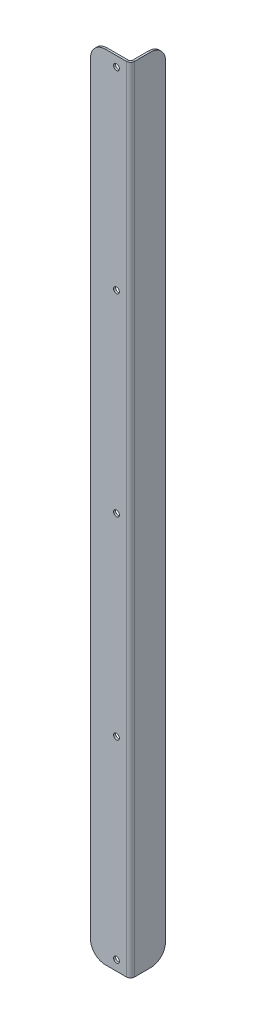
ISO-10303-21;
HEADER;
FILE_DESCRIPTION(('STEP AP214'),'2;1');
FILE_NAME('part.step','',(''),(''),'','','');
FILE_SCHEMA(('AUTOMOTIVE_DESIGN { 1 0 10303 214 1 1 1 1 }'));
ENDSEC;
DATA;
#1=APPLICATION_CONTEXT('core data for automotive mechanical design processes');
#2=APPLICATION_PROTOCOL_DEFINITION('international standard','automotive_design',2000,#1);
#3=PRODUCT_CONTEXT('',#1,'mechanical');
#4=PRODUCT('Part','Part','',(#3));
#5=PRODUCT_RELATED_PRODUCT_CATEGORY('part','',(#4));
#6=PRODUCT_DEFINITION_FORMATION('','',#4);
#7=PRODUCT_DEFINITION_CONTEXT('part definition',#1,'design');
#8=PRODUCT_DEFINITION('design','',#6,#7);
#9=PRODUCT_DEFINITION_SHAPE('','',#8);
#10=(LENGTH_UNIT() NAMED_UNIT(*) SI_UNIT(.MILLI.,.METRE.));
#11=(NAMED_UNIT(*) PLANE_ANGLE_UNIT() SI_UNIT($,.RADIAN.));
#12=(NAMED_UNIT(*) SI_UNIT($,.STERADIAN.) SOLID_ANGLE_UNIT());
#13=UNCERTAINTY_MEASURE_WITH_UNIT(LENGTH_MEASURE(1.E-05),#10,'distance_accuracy_value','');
#14=(GEOMETRIC_REPRESENTATION_CONTEXT(3) GLOBAL_UNCERTAINTY_ASSIGNED_CONTEXT((#13)) GLOBAL_UNIT_ASSIGNED_CONTEXT((#10,
#11,#12)) REPRESENTATION_CONTEXT('',''));
#15=CARTESIAN_POINT('',(0.,0.,0.));
#16=DIRECTION('',(0.,0.,1.));
#17=DIRECTION('',(1.,0.,0.));
#18=AXIS2_PLACEMENT_3D('',#15,#16,#17);
#19=CARTESIAN_POINT('',(6.00749999999836,386.,0.));
#20=DIRECTION('',(0.,0.,-1.));
#21=DIRECTION('',(1.,0.,0.));
#22=AXIS2_PLACEMENT_3D('',#19,#20,#21);
#23=CYLINDRICAL_SURFACE('',#22,2.9);
#24=CARTESIAN_POINT('',(6.00749999999836,386.,2.00000000000001));
#25=DIRECTION('',(0.,0.,1.));
#26=DIRECTION('',(1.,0.,0.));
#27=AXIS2_PLACEMENT_3D('',#24,#25,#26);
#28=CIRCLE('',#27,2.9);
#29=CARTESIAN_POINT('',(8.90749999999836,386.,2.00000000000001));
#30=VERTEX_POINT('',#29);
#31=EDGE_CURVE('E241',#30,#30,#28,.T.);
#32=ORIENTED_EDGE('',*,*,#31,.T.);
#33=EDGE_LOOP('',(#32));
#34=FACE_BOUND('',#33,.T.);
#35=CARTESIAN_POINT('',(6.00749999999836,386.,0.));
#36=DIRECTION('',(0.,0.,1.));
#37=DIRECTION('',(1.,0.,0.));
#38=AXIS2_PLACEMENT_3D('',#35,#36,#37);
#39=CIRCLE('',#38,2.9);
#40=CARTESIAN_POINT('',(8.90749999999836,386.,0.));
#41=VERTEX_POINT('',#40);
#42=EDGE_CURVE('E245',#41,#41,#39,.T.);
#43=ORIENTED_EDGE('',*,*,#42,.F.);
#44=EDGE_LOOP('',(#43));
#45=FACE_BOUND('',#44,.T.);
#46=ADVANCED_FACE('F43',(#34,#45),#23,.F.);
#47=CARTESIAN_POINT('',(6.00749999999836,193.,0.));
#48=DIRECTION('',(0.,0.,-1.));
#49=DIRECTION('',(1.,0.,0.));
#50=AXIS2_PLACEMENT_3D('',#47,#48,#49);
#51=CYLINDRICAL_SURFACE('',#50,2.9);
#52=CARTESIAN_POINT('',(6.00749999999836,193.,2.00000000000001));
#53=DIRECTION('',(0.,0.,1.));
#54=DIRECTION('',(1.,0.,0.));
#55=AXIS2_PLACEMENT_3D('',#52,#53,#54);
#56=CIRCLE('',#55,2.9);
#57=CARTESIAN_POINT('',(8.90749999999836,193.,2.00000000000001));
#58=VERTEX_POINT('',#57);
#59=EDGE_CURVE('E233',#58,#58,#56,.T.);
#60=ORIENTED_EDGE('',*,*,#59,.T.);
#61=EDGE_LOOP('',(#60));
#62=FACE_BOUND('',#61,.T.);
#63=CARTESIAN_POINT('',(6.00749999999836,193.,0.));
#64=DIRECTION('',(0.,0.,1.));
#65=DIRECTION('',(1.,0.,0.));
#66=AXIS2_PLACEMENT_3D('',#63,#64,#65);
#67=CIRCLE('',#66,2.9);
#68=CARTESIAN_POINT('',(8.90749999999836,193.,0.));
#69=VERTEX_POINT('',#68);
#70=EDGE_CURVE('E237',#69,#69,#67,.T.);
#71=ORIENTED_EDGE('',*,*,#70,.F.);
#72=EDGE_LOOP('',(#71));
#73=FACE_BOUND('',#72,.T.);
#74=ADVANCED_FACE('F387',(#62,#73),#51,.F.);
#75=CARTESIAN_POINT('',(6.00749999999836,0.,0.));
#76=DIRECTION('',(0.,0.,-1.));
#77=DIRECTION('',(1.,0.,0.));
#78=AXIS2_PLACEMENT_3D('',#75,#76,#77);
#79=CYLINDRICAL_SURFACE('',#78,2.9);
#80=CARTESIAN_POINT('',(6.00749999999836,0.,2.00000000000001));
#81=DIRECTION('',(0.,0.,1.));
#82=DIRECTION('',(1.,0.,0.));
#83=AXIS2_PLACEMENT_3D('',#80,#81,#82);
#84=CIRCLE('',#83,2.9);
#85=CARTESIAN_POINT('',(8.90749999999836,0.,2.00000000000001));
#86=VERTEX_POINT('',#85);
#87=EDGE_CURVE('E216',#86,#86,#84,.T.);
#88=ORIENTED_EDGE('',*,*,#87,.T.);
#89=EDGE_LOOP('',(#88));
#90=FACE_BOUND('',#89,.T.);
#91=CARTESIAN_POINT('',(6.00749999999836,0.,0.));
#92=DIRECTION('',(0.,0.,1.));
#93=DIRECTION('',(1.,0.,0.));
#94=AXIS2_PLACEMENT_3D('',#91,#92,#93);
#95=CIRCLE('',#94,2.9);
#96=CARTESIAN_POINT('',(8.90749999999836,0.,0.));
#97=VERTEX_POINT('',#96);
#98=EDGE_CURVE('E229',#97,#97,#95,.T.);
#99=ORIENTED_EDGE('',*,*,#98,.F.);
#100=EDGE_LOOP('',(#99));
#101=FACE_BOUND('',#100,.T.);
#102=ADVANCED_FACE('F393',(#90,#101),#79,.F.);
#103=CARTESIAN_POINT('',(-20.,396.,2.));
#104=DIRECTION('',(0.,1.,0.));
#105=DIRECTION('',(0.,0.,-1.));
#106=AXIS2_PLACEMENT_3D('',#103,#104,#105);
#107=PLANE('',#106);
#108=DIRECTION('',(-1.,0.,0.));
#109=VECTOR('',#108,1.);
#110=CARTESIAN_POINT('',(-20.,396.,2.));
#111=LINE('',#110,#109);
#112=CARTESIAN_POINT('',(16.,396.,2.00000000000001));
#113=VERTEX_POINT('',#112);
#114=CARTESIAN_POINT('',(-5.,396.,2.));
#115=VERTEX_POINT('',#114);
#116=EDGE_CURVE('E203',#113,#115,#111,.T.);
#117=ORIENTED_EDGE('',*,*,#116,.F.);
#118=DIRECTION('',(0.,0.,1.));
#119=VECTOR('',#118,1.);
#120=CARTESIAN_POINT('',(16.,396.,0.));
#121=LINE('',#120,#119);
#122=CARTESIAN_POINT('',(16.,396.,0.));
#123=VERTEX_POINT('',#122);
#124=EDGE_CURVE('E175',#123,#113,#121,.T.);
#125=ORIENTED_EDGE('',*,*,#124,.F.);
#126=DIRECTION('',(-1.,0.,0.));
#127=VECTOR('',#126,1.);
#128=CARTESIAN_POINT('',(-20.,396.,0.));
#129=LINE('',#128,#127);
#130=CARTESIAN_POINT('',(-5.,396.,0.));
#131=VERTEX_POINT('',#130);
#132=EDGE_CURVE('E200',#123,#131,#129,.T.);
#133=ORIENTED_EDGE('',*,*,#132,.T.);
#134=DIRECTION('',(0.,0.,-1.));
#135=VECTOR('',#134,1.);
#136=CARTESIAN_POINT('',(-5.,396.,2.));
#137=LINE('',#136,#135);
#138=EDGE_CURVE('E270',#115,#131,#137,.T.);
#139=ORIENTED_EDGE('',*,*,#138,.F.);
#140=EDGE_LOOP('',(#117,#125,#133,#139));
#141=FACE_BOUND('',#140,.T.);
#142=ADVANCED_FACE('F365',(#141),#107,.T.);
#143=CARTESIAN_POINT('',(0.,0.,2.));
#144=DIRECTION('',(0.,0.,1.));
#145=DIRECTION('',(-1.,0.,0.));
#146=AXIS2_PLACEMENT_3D('',#143,#144,#145);
#147=PLANE('',#146);
#148=CARTESIAN_POINT('',(6.00749999999836,-193.,2.00000000000001));
#149=DIRECTION('',(0.,0.,1.));
#150=DIRECTION('',(1.,0.,0.));
#151=AXIS2_PLACEMENT_3D('',#148,#149,#150);
#152=CIRCLE('',#151,2.9);
#153=CARTESIAN_POINT('',(8.90749999999836,-193.,2.00000000000001));
#154=VERTEX_POINT('',#153);
#155=EDGE_CURVE('E310',#154,#154,#152,.T.);
#156=ORIENTED_EDGE('',*,*,#155,.F.);
#157=EDGE_LOOP('',(#156));
#158=FACE_BOUND('',#157,.T.);
#159=CARTESIAN_POINT('',(6.00749999999836,-386.,2.00000000000001));
#160=DIRECTION('',(0.,0.,1.));
#161=DIRECTION('',(1.,0.,0.));
#162=AXIS2_PLACEMENT_3D('',#159,#160,#161);
#163=CIRCLE('',#162,2.9);
#164=CARTESIAN_POINT('',(8.90749999999836,-386.,2.00000000000001));
#165=VERTEX_POINT('',#164);
#166=EDGE_CURVE('E299',#165,#165,#163,.T.);
#167=ORIENTED_EDGE('',*,*,#166,.F.);
#168=EDGE_LOOP('',(#167));
#169=FACE_BOUND('',#168,.T.);
#170=DIRECTION('',(0.,-1.,0.));
#171=VECTOR('',#170,1.);
#172=CARTESIAN_POINT('',(-20.,-396.,2.));
#173=LINE('',#172,#171);
#174=CARTESIAN_POINT('',(-20.,381.,2.));
#175=VERTEX_POINT('',#174);
#176=CARTESIAN_POINT('',(-20.,-381.,2.));
#177=VERTEX_POINT('',#176);
#178=EDGE_CURVE('E207',#175,#177,#173,.T.);
#179=ORIENTED_EDGE('',*,*,#178,.T.);
#180=CARTESIAN_POINT('',(-5.,-381.,2.));
#181=DIRECTION('',(0.,0.,-1.));
#182=DIRECTION('',(-1.,0.,0.));
#183=AXIS2_PLACEMENT_3D('',#180,#181,#182);
#184=CIRCLE('',#183,15.);
#185=CARTESIAN_POINT('',(-5.,-396.,2.));
#186=VERTEX_POINT('',#185);
#187=EDGE_CURVE('E286',#186,#177,#184,.T.);
#188=ORIENTED_EDGE('',*,*,#187,.F.);
#189=DIRECTION('',(1.,0.,0.));
#190=VECTOR('',#189,1.);
#191=CARTESIAN_POINT('',(-20.,-396.,2.));
#192=LINE('',#191,#190);
#193=CARTESIAN_POINT('',(16.,-396.,2.));
#194=VERTEX_POINT('',#193);
#195=EDGE_CURVE('E212',#186,#194,#192,.T.);
#196=ORIENTED_EDGE('',*,*,#195,.T.);
#197=DIRECTION('',(0.,1.,0.));
#198=VECTOR('',#197,1.);
#199=CARTESIAN_POINT('',(16.,396.,2.00000000000001));
#200=LINE('',#199,#198);
#201=EDGE_CURVE('E178',#113,#194,#200,.F.);
#202=ORIENTED_EDGE('',*,*,#201,.F.);
#203=ORIENTED_EDGE('',*,*,#116,.T.);
#204=CARTESIAN_POINT('',(-5.,381.,2.));
#205=DIRECTION('',(0.,0.,-1.));
#206=DIRECTION('',(-1.,0.,0.));
#207=AXIS2_PLACEMENT_3D('',#204,#205,#206);
#208=CIRCLE('',#207,15.);
#209=EDGE_CURVE('E289',#175,#115,#208,.T.);
#210=ORIENTED_EDGE('',*,*,#209,.F.);
#211=EDGE_LOOP('',(#179,#188,#196,#202,#203,#210));
#212=FACE_BOUND('',#211,.T.);
#213=ORIENTED_EDGE('',*,*,#87,.F.);
#214=EDGE_LOOP('',(#213));
#215=FACE_BOUND('',#214,.T.);
#216=ORIENTED_EDGE('',*,*,#59,.F.);
#217=EDGE_LOOP('',(#216));
#218=FACE_BOUND('',#217,.T.);
#219=ORIENTED_EDGE('',*,*,#31,.F.);
#220=EDGE_LOOP('',(#219));
#221=FACE_BOUND('',#220,.T.);
#222=ADVANCED_FACE('F368',(#158,#169,#212,#215,#218,#221),#147,.T.);
#223=CARTESIAN_POINT('',(0.,0.,0.));
#224=DIRECTION('',(0.,0.,1.));
#225=DIRECTION('',(-1.,0.,0.));
#226=AXIS2_PLACEMENT_3D('',#223,#224,#225);
#227=PLANE('',#226);
#228=CARTESIAN_POINT('',(6.00749999999836,-193.,0.));
#229=DIRECTION('',(0.,0.,1.));
#230=DIRECTION('',(1.,0.,0.));
#231=AXIS2_PLACEMENT_3D('',#228,#229,#230);
#232=CIRCLE('',#231,2.9);
#233=CARTESIAN_POINT('',(8.90749999999836,-193.,0.));
#234=VERTEX_POINT('',#233);
#235=EDGE_CURVE('E300',#234,#234,#232,.T.);
#236=ORIENTED_EDGE('',*,*,#235,.T.);
#237=EDGE_LOOP('',(#236));
#238=FACE_BOUND('',#237,.T.);
#239=CARTESIAN_POINT('',(6.00749999999836,-386.,0.));
#240=DIRECTION('',(0.,0.,1.));
#241=DIRECTION('',(1.,0.,0.));
#242=AXIS2_PLACEMENT_3D('',#239,#240,#241);
#243=CIRCLE('',#242,2.9);
#244=CARTESIAN_POINT('',(8.90749999999836,-386.,0.));
#245=VERTEX_POINT('',#244);
#246=EDGE_CURVE('E295',#245,#245,#243,.T.);
#247=ORIENTED_EDGE('',*,*,#246,.T.);
#248=EDGE_LOOP('',(#247));
#249=FACE_BOUND('',#248,.T.);
#250=ORIENTED_EDGE('',*,*,#132,.F.);
#251=DIRECTION('',(0.,1.,0.));
#252=VECTOR('',#251,1.);
#253=CARTESIAN_POINT('',(16.,396.,0.));
#254=LINE('',#253,#252);
#255=CARTESIAN_POINT('',(16.,-396.,0.));
#256=VERTEX_POINT('',#255);
#257=EDGE_CURVE('E186',#123,#256,#254,.F.);
#258=ORIENTED_EDGE('',*,*,#257,.T.);
#259=DIRECTION('',(1.,0.,0.));
#260=VECTOR('',#259,1.);
#261=CARTESIAN_POINT('',(-20.,-396.,0.));
#262=LINE('',#261,#260);
#263=CARTESIAN_POINT('',(-5.,-396.,0.));
#264=VERTEX_POINT('',#263);
#265=EDGE_CURVE('E208',#264,#256,#262,.T.);
#266=ORIENTED_EDGE('',*,*,#265,.F.);
#267=CARTESIAN_POINT('',(-5.,-381.,0.));
#268=DIRECTION('',(0.,0.,-1.));
#269=DIRECTION('',(-1.,0.,0.));
#270=AXIS2_PLACEMENT_3D('',#267,#268,#269);
#271=CIRCLE('',#270,15.);
#272=CARTESIAN_POINT('',(-20.,-381.,0.));
#273=VERTEX_POINT('',#272);
#274=EDGE_CURVE('E274',#273,#264,#271,.F.);
#275=ORIENTED_EDGE('',*,*,#274,.F.);
#276=DIRECTION('',(0.,-1.,0.));
#277=VECTOR('',#276,1.);
#278=CARTESIAN_POINT('',(-20.,-396.,0.));
#279=LINE('',#278,#277);
#280=CARTESIAN_POINT('',(-20.,381.,0.));
#281=VERTEX_POINT('',#280);
#282=EDGE_CURVE('E220',#281,#273,#279,.T.);
#283=ORIENTED_EDGE('',*,*,#282,.F.);
#284=CARTESIAN_POINT('',(-5.,381.,0.));
#285=DIRECTION('',(0.,0.,-1.));
#286=DIRECTION('',(-1.,0.,0.));
#287=AXIS2_PLACEMENT_3D('',#284,#285,#286);
#288=CIRCLE('',#287,15.);
#289=EDGE_CURVE('E277',#131,#281,#288,.F.);
#290=ORIENTED_EDGE('',*,*,#289,.F.);
#291=EDGE_LOOP('',(#250,#258,#266,#275,#283,#290));
#292=FACE_BOUND('',#291,.T.);
#293=ORIENTED_EDGE('',*,*,#98,.T.);
#294=EDGE_LOOP('',(#293));
#295=FACE_BOUND('',#294,.T.);
#296=ORIENTED_EDGE('',*,*,#70,.T.);
#297=EDGE_LOOP('',(#296));
#298=FACE_BOUND('',#297,.T.);
#299=ORIENTED_EDGE('',*,*,#42,.T.);
#300=EDGE_LOOP('',(#299));
#301=FACE_BOUND('',#300,.T.);
#302=ADVANCED_FACE('F360',(#238,#249,#292,#295,#298,#301),#227,.F.);
#303=CARTESIAN_POINT('',(-20.,-396.,2.));
#304=DIRECTION('',(0.,-1.,0.));
#305=DIRECTION('',(0.,0.,1.));
#306=AXIS2_PLACEMENT_3D('',#303,#304,#305);
#307=PLANE('',#306);
#308=ORIENTED_EDGE('',*,*,#265,.T.);
#309=DIRECTION('',(0.,0.,1.));
#310=VECTOR('',#309,1.);
#311=CARTESIAN_POINT('',(16.,-396.,0.));
#312=LINE('',#311,#310);
#313=EDGE_CURVE('E196',#256,#194,#312,.T.);
#314=ORIENTED_EDGE('',*,*,#313,.T.);
#315=ORIENTED_EDGE('',*,*,#195,.F.);
#316=DIRECTION('',(0.,0.,-1.));
#317=VECTOR('',#316,1.);
#318=CARTESIAN_POINT('',(-5.,-396.,2.));
#319=LINE('',#318,#317);
#320=EDGE_CURVE('E52',#264,#186,#319,.F.);
#321=ORIENTED_EDGE('',*,*,#320,.F.);
#322=EDGE_LOOP('',(#308,#314,#315,#321));
#323=FACE_BOUND('',#322,.T.);
#324=ADVANCED_FACE('F372',(#323),#307,.T.);
#325=CARTESIAN_POINT('',(-20.,-396.,2.));
#326=DIRECTION('',(-1.,0.,0.));
#327=DIRECTION('',(0.,0.,-1.));
#328=AXIS2_PLACEMENT_3D('',#325,#326,#327);
#329=PLANE('',#328);
#330=ORIENTED_EDGE('',*,*,#282,.T.);
#331=DIRECTION('',(0.,0.,-1.));
#332=VECTOR('',#331,1.);
#333=CARTESIAN_POINT('',(-20.,-381.,2.));
#334=LINE('',#333,#332);
#335=EDGE_CURVE('E66',#177,#273,#334,.T.);
#336=ORIENTED_EDGE('',*,*,#335,.F.);
#337=ORIENTED_EDGE('',*,*,#178,.F.);
#338=DIRECTION('',(0.,0.,-1.));
#339=VECTOR('',#338,1.);
#340=CARTESIAN_POINT('',(-20.,381.,2.));
#341=LINE('',#340,#339);
#342=EDGE_CURVE('E283',#281,#175,#341,.F.);
#343=ORIENTED_EDGE('',*,*,#342,.F.);
#344=EDGE_LOOP('',(#330,#336,#337,#343));
#345=FACE_BOUND('',#344,.T.);
#346=ADVANCED_FACE('F375',(#345),#329,.T.);
#347=CARTESIAN_POINT('',(16.,-396.,-1.99999999999999));
#348=DIRECTION('',(0.,-1.,0.));
#349=DIRECTION('',(0.,0.,1.));
#350=AXIS2_PLACEMENT_3D('',#347,#348,#349);
#351=PLANE('',#350);
#352=DIRECTION('',(-1.,0.,0.));
#353=VECTOR('',#352,1.);
#354=CARTESIAN_POINT('',(20.,-396.,-1.99999999999999));
#355=LINE('',#354,#353);
#356=CARTESIAN_POINT('',(18.,-396.,-1.99999999999999));
#357=VERTEX_POINT('',#356);
#358=CARTESIAN_POINT('',(20.,-396.,-1.99999999999998));
#359=VERTEX_POINT('',#358);
#360=EDGE_CURVE('E305',#357,#359,#355,.F.);
#361=ORIENTED_EDGE('',*,*,#360,.T.);
#362=CARTESIAN_POINT('',(16.,-396.,-1.99999999999999));
#363=DIRECTION('',(0.,-1.,0.));
#364=DIRECTION('',(0.,0.,-1.));
#365=AXIS2_PLACEMENT_3D('',#362,#363,#364);
#366=CIRCLE('',#365,4.);
#367=EDGE_CURVE('E156',#194,#359,#366,.F.);
#368=ORIENTED_EDGE('',*,*,#367,.F.);
#369=ORIENTED_EDGE('',*,*,#313,.F.);
#370=CARTESIAN_POINT('',(16.,-396.,-1.99999999999999));
#371=DIRECTION('',(0.,-1.,0.));
#372=DIRECTION('',(0.,0.,-1.));
#373=AXIS2_PLACEMENT_3D('',#370,#371,#372);
#374=CIRCLE('',#373,2.);
#375=EDGE_CURVE('E179',#256,#357,#374,.F.);
#376=ORIENTED_EDGE('',*,*,#375,.T.);
#377=EDGE_LOOP('',(#361,#368,#369,#376));
#378=FACE_BOUND('',#377,.T.);
#379=ADVANCED_FACE('F337',(#378),#351,.T.);
#380=CARTESIAN_POINT('',(16.,396.,-1.99999999999999));
#381=DIRECTION('',(0.,-1.,0.));
#382=DIRECTION('',(0.,0.,1.));
#383=AXIS2_PLACEMENT_3D('',#380,#381,#382);
#384=PLANE('',#383);
#385=CARTESIAN_POINT('',(16.,396.,-1.99999999999999));
#386=DIRECTION('',(0.,-1.,0.));
#387=DIRECTION('',(0.,0.,-1.));
#388=AXIS2_PLACEMENT_3D('',#385,#386,#387);
#389=CIRCLE('',#388,2.);
#390=CARTESIAN_POINT('',(18.,396.,-1.99999999999999));
#391=VERTEX_POINT('',#390);
#392=EDGE_CURVE('E193',#391,#123,#389,.T.);
#393=ORIENTED_EDGE('',*,*,#392,.T.);
#394=ORIENTED_EDGE('',*,*,#124,.T.);
#395=CARTESIAN_POINT('',(16.,396.,-1.99999999999999));
#396=DIRECTION('',(0.,-1.,0.));
#397=DIRECTION('',(0.,0.,-1.));
#398=AXIS2_PLACEMENT_3D('',#395,#396,#397);
#399=CIRCLE('',#398,4.);
#400=CARTESIAN_POINT('',(20.,396.,-1.99999999999997));
#401=VERTEX_POINT('',#400);
#402=EDGE_CURVE('E154',#401,#113,#399,.T.);
#403=ORIENTED_EDGE('',*,*,#402,.F.);
#404=DIRECTION('',(-1.,0.,0.));
#405=VECTOR('',#404,1.);
#406=CARTESIAN_POINT('',(18.,396.,-1.99999999999998));
#407=LINE('',#406,#405);
#408=EDGE_CURVE('E160',#391,#401,#407,.F.);
#409=ORIENTED_EDGE('',*,*,#408,.F.);
#410=EDGE_LOOP('',(#393,#394,#403,#409));
#411=FACE_BOUND('',#410,.T.);
#412=ADVANCED_FACE('F173',(#411),#384,.F.);
#413=CARTESIAN_POINT('',(16.,396.,-1.99999999999999));
#414=DIRECTION('',(0.,1.,0.));
#415=DIRECTION('',(1.,0.,0.));
#416=AXIS2_PLACEMENT_3D('',#413,#414,#415);
#417=CYLINDRICAL_SURFACE('',#416,4.);
#418=ORIENTED_EDGE('',*,*,#201,.T.);
#419=ORIENTED_EDGE('',*,*,#367,.T.);
#420=DIRECTION('',(0.,1.,0.));
#421=VECTOR('',#420,1.);
#422=CARTESIAN_POINT('',(20.,-396.,-1.99999999999999));
#423=LINE('',#422,#421);
#424=EDGE_CURVE('E137',#401,#359,#423,.F.);
#425=ORIENTED_EDGE('',*,*,#424,.F.);
#426=ORIENTED_EDGE('',*,*,#402,.T.);
#427=EDGE_LOOP('',(#418,#419,#425,#426));
#428=FACE_BOUND('',#427,.T.);
#429=ADVANCED_FACE('F152',(#428),#417,.T.);
#430=CARTESIAN_POINT('',(16.,396.,-1.99999999999999));
#431=DIRECTION('',(0.,1.,0.));
#432=DIRECTION('',(1.,0.,0.));
#433=AXIS2_PLACEMENT_3D('',#430,#431,#432);
#434=CYLINDRICAL_SURFACE('',#433,2.);
#435=ORIENTED_EDGE('',*,*,#257,.F.);
#436=ORIENTED_EDGE('',*,*,#392,.F.);
#437=DIRECTION('',(0.,1.,0.));
#438=VECTOR('',#437,1.);
#439=CARTESIAN_POINT('',(18.,-396.,-1.99999999999999));
#440=LINE('',#439,#438);
#441=EDGE_CURVE('E170',#357,#391,#440,.T.);
#442=ORIENTED_EDGE('',*,*,#441,.F.);
#443=ORIENTED_EDGE('',*,*,#375,.F.);
#444=EDGE_LOOP('',(#435,#436,#442,#443));
#445=FACE_BOUND('',#444,.T.);
#446=ADVANCED_FACE('F356',(#445),#434,.F.);
#447=CARTESIAN_POINT('',(20.,-396.,0.));
#448=DIRECTION('',(0.,1.,0.));
#449=DIRECTION('',(0.,0.,-1.));
#450=AXIS2_PLACEMENT_3D('',#447,#448,#449);
#451=PLANE('',#450);
#452=DIRECTION('',(0.,0.,1.));
#453=VECTOR('',#452,1.);
#454=CARTESIAN_POINT('',(20.,-396.,0.));
#455=LINE('',#454,#453);
#456=CARTESIAN_POINT('',(20.0000000000001,-396.,-18.));
#457=VERTEX_POINT('',#456);
#458=EDGE_CURVE('E148',#457,#359,#455,.T.);
#459=ORIENTED_EDGE('',*,*,#458,.T.);
#460=ORIENTED_EDGE('',*,*,#360,.F.);
#461=DIRECTION('',(0.,0.,-1.));
#462=VECTOR('',#461,1.);
#463=CARTESIAN_POINT('',(18.,-396.,0.));
#464=LINE('',#463,#462);
#465=CARTESIAN_POINT('',(18.0000000000001,-396.,-18.));
#466=VERTEX_POINT('',#465);
#467=EDGE_CURVE('E159',#466,#357,#464,.F.);
#468=ORIENTED_EDGE('',*,*,#467,.F.);
#469=DIRECTION('',(-1.,0.,0.));
#470=VECTOR('',#469,1.);
#471=CARTESIAN_POINT('',(20.0000000000001,-396.,-18.));
#472=LINE('',#471,#470);
#473=EDGE_CURVE('E11',#457,#466,#472,.T.);
#474=ORIENTED_EDGE('',*,*,#473,.F.);
#475=EDGE_LOOP('',(#459,#460,#468,#474));
#476=FACE_BOUND('',#475,.T.);
#477=ADVANCED_FACE('F341',(#476),#451,.F.);
#478=CARTESIAN_POINT('',(20.0000000000001,396.,-33.));
#479=DIRECTION('',(0.,-1.,0.));
#480=DIRECTION('',(0.,0.,1.));
#481=AXIS2_PLACEMENT_3D('',#478,#479,#480);
#482=PLANE('',#481);
#483=DIRECTION('',(0.,0.,1.));
#484=VECTOR('',#483,1.);
#485=CARTESIAN_POINT('',(18.0000000000001,396.,-33.));
#486=LINE('',#485,#484);
#487=CARTESIAN_POINT('',(18.0000000000001,396.,-18.));
#488=VERTEX_POINT('',#487);
#489=EDGE_CURVE('E165',#391,#488,#486,.F.);
#490=ORIENTED_EDGE('',*,*,#489,.F.);
#491=ORIENTED_EDGE('',*,*,#408,.T.);
#492=DIRECTION('',(0.,0.,-1.));
#493=VECTOR('',#492,1.);
#494=CARTESIAN_POINT('',(20.,396.,-5.89761913058335E-13));
#495=LINE('',#494,#493);
#496=CARTESIAN_POINT('',(20.0000000000001,396.,-18.));
#497=VERTEX_POINT('',#496);
#498=EDGE_CURVE('E133',#401,#497,#495,.T.);
#499=ORIENTED_EDGE('',*,*,#498,.T.);
#500=DIRECTION('',(-1.,0.,0.));
#501=VECTOR('',#500,1.);
#502=CARTESIAN_POINT('',(20.0000000000001,396.,-18.));
#503=LINE('',#502,#501);
#504=EDGE_CURVE('E262',#488,#497,#503,.F.);
#505=ORIENTED_EDGE('',*,*,#504,.F.);
#506=EDGE_LOOP('',(#490,#491,#499,#505));
#507=FACE_BOUND('',#506,.T.);
#508=ADVANCED_FACE('F163',(#507),#482,.F.);
#509=CARTESIAN_POINT('',(20.,0.,0.));
#510=DIRECTION('',(-1.,0.,0.));
#511=DIRECTION('',(0.,0.,-1.));
#512=AXIS2_PLACEMENT_3D('',#509,#510,#511);
#513=PLANE('',#512);
#514=ORIENTED_EDGE('',*,*,#498,.F.);
#515=ORIENTED_EDGE('',*,*,#424,.T.);
#516=ORIENTED_EDGE('',*,*,#458,.F.);
#517=CARTESIAN_POINT('',(20.0000000000001,-381.,-18.));
#518=DIRECTION('',(1.,0.,0.));
#519=DIRECTION('',(0.,0.,-1.));
#520=AXIS2_PLACEMENT_3D('',#517,#518,#519);
#521=CIRCLE('',#520,15.);
#522=CARTESIAN_POINT('',(20.0000000000001,-381.,-33.));
#523=VERTEX_POINT('',#522);
#524=EDGE_CURVE('E265',#523,#457,#521,.F.);
#525=ORIENTED_EDGE('',*,*,#524,.F.);
#526=DIRECTION('',(0.,-1.,0.));
#527=VECTOR('',#526,1.);
#528=CARTESIAN_POINT('',(20.0000000000001,0.,-33.));
#529=LINE('',#528,#527);
#530=CARTESIAN_POINT('',(20.0000000000001,381.,-33.));
#531=VERTEX_POINT('',#530);
#532=EDGE_CURVE('E147',#531,#523,#529,.T.);
#533=ORIENTED_EDGE('',*,*,#532,.F.);
#534=CARTESIAN_POINT('',(20.0000000000001,381.,-18.));
#535=DIRECTION('',(1.,0.,0.));
#536=DIRECTION('',(0.,0.,-1.));
#537=AXIS2_PLACEMENT_3D('',#534,#535,#536);
#538=CIRCLE('',#537,15.);
#539=EDGE_CURVE('E141',#497,#531,#538,.F.);
#540=ORIENTED_EDGE('',*,*,#539,.F.);
#541=EDGE_LOOP('',(#514,#515,#516,#525,#533,#540));
#542=FACE_BOUND('',#541,.T.);
#543=ADVANCED_FACE('F135',(#542),#513,.F.);
#544=CARTESIAN_POINT('',(18.,0.,0.));
#545=DIRECTION('',(-1.,0.,0.));
#546=DIRECTION('',(0.,0.,-1.));
#547=AXIS2_PLACEMENT_3D('',#544,#545,#546);
#548=PLANE('',#547);
#549=DIRECTION('',(0.,1.,0.));
#550=VECTOR('',#549,1.);
#551=CARTESIAN_POINT('',(18.0000000000001,-396.,-33.));
#552=LINE('',#551,#550);
#553=CARTESIAN_POINT('',(18.0000000000001,381.,-33.));
#554=VERTEX_POINT('',#553);
#555=CARTESIAN_POINT('',(18.0000000000001,-381.,-33.));
#556=VERTEX_POINT('',#555);
#557=EDGE_CURVE('E323',#554,#556,#552,.F.);
#558=ORIENTED_EDGE('',*,*,#557,.T.);
#559=CARTESIAN_POINT('',(18.0000000000001,-381.,-18.));
#560=DIRECTION('',(1.,0.,0.));
#561=DIRECTION('',(0.,0.,-1.));
#562=AXIS2_PLACEMENT_3D('',#559,#560,#561);
#563=CIRCLE('',#562,15.);
#564=EDGE_CURVE('E255',#466,#556,#563,.T.);
#565=ORIENTED_EDGE('',*,*,#564,.F.);
#566=ORIENTED_EDGE('',*,*,#467,.T.);
#567=ORIENTED_EDGE('',*,*,#441,.T.);
#568=ORIENTED_EDGE('',*,*,#489,.T.);
#569=CARTESIAN_POINT('',(18.0000000000001,381.,-18.));
#570=DIRECTION('',(1.,0.,0.));
#571=DIRECTION('',(0.,0.,-1.));
#572=AXIS2_PLACEMENT_3D('',#569,#570,#571);
#573=CIRCLE('',#572,15.);
#574=EDGE_CURVE('E259',#554,#488,#573,.T.);
#575=ORIENTED_EDGE('',*,*,#574,.F.);
#576=EDGE_LOOP('',(#558,#565,#566,#567,#568,#575));
#577=FACE_BOUND('',#576,.T.);
#578=ADVANCED_FACE('F352',(#577),#548,.T.);
#579=CARTESIAN_POINT('',(20.0000000000001,-396.,-33.));
#580=DIRECTION('',(0.,0.,1.));
#581=DIRECTION('',(-1.,0.,0.));
#582=AXIS2_PLACEMENT_3D('',#579,#580,#581);
#583=PLANE('',#582);
#584=ORIENTED_EDGE('',*,*,#532,.T.);
#585=DIRECTION('',(-1.,0.,0.));
#586=VECTOR('',#585,1.);
#587=CARTESIAN_POINT('',(20.0000000000001,-381.,-33.));
#588=LINE('',#587,#586);
#589=EDGE_CURVE('E249',#556,#523,#588,.F.);
#590=ORIENTED_EDGE('',*,*,#589,.F.);
#591=ORIENTED_EDGE('',*,*,#557,.F.);
#592=DIRECTION('',(-1.,0.,0.));
#593=VECTOR('',#592,1.);
#594=CARTESIAN_POINT('',(20.0000000000001,381.,-33.));
#595=LINE('',#594,#593);
#596=EDGE_CURVE('E252',#531,#554,#595,.T.);
#597=ORIENTED_EDGE('',*,*,#596,.F.);
#598=EDGE_LOOP('',(#584,#590,#591,#597));
#599=FACE_BOUND('',#598,.T.);
#600=ADVANCED_FACE('F347',(#599),#583,.F.);
#601=CARTESIAN_POINT('',(6.00749999999836,-386.,0.));
#602=DIRECTION('',(0.,0.,-1.));
#603=DIRECTION('',(1.,0.,0.));
#604=AXIS2_PLACEMENT_3D('',#601,#602,#603);
#605=CYLINDRICAL_SURFACE('',#604,2.9);
#606=ORIENTED_EDGE('',*,*,#166,.T.);
#607=EDGE_LOOP('',(#606));
#608=FACE_BOUND('',#607,.T.);
#609=ORIENTED_EDGE('',*,*,#246,.F.);
#610=EDGE_LOOP('',(#609));
#611=FACE_BOUND('',#610,.T.);
#612=ADVANCED_FACE('F427',(#608,#611),#605,.F.);
#613=CARTESIAN_POINT('',(6.00749999999836,-193.,0.));
#614=DIRECTION('',(0.,0.,-1.));
#615=DIRECTION('',(1.,0.,0.));
#616=AXIS2_PLACEMENT_3D('',#613,#614,#615);
#617=CYLINDRICAL_SURFACE('',#616,2.9);
#618=ORIENTED_EDGE('',*,*,#155,.T.);
#619=EDGE_LOOP('',(#618));
#620=FACE_BOUND('',#619,.T.);
#621=ORIENTED_EDGE('',*,*,#235,.F.);
#622=EDGE_LOOP('',(#621));
#623=FACE_BOUND('',#622,.T.);
#624=ADVANCED_FACE('F384',(#620,#623),#617,.F.);
#625=CARTESIAN_POINT('',(20.0000000000001,381.,-18.));
#626=DIRECTION('',(-1.,0.,0.));
#627=DIRECTION('',(0.,0.,-1.));
#628=AXIS2_PLACEMENT_3D('',#625,#626,#627);
#629=CYLINDRICAL_SURFACE('',#628,15.);
#630=ORIENTED_EDGE('',*,*,#539,.T.);
#631=ORIENTED_EDGE('',*,*,#596,.T.);
#632=ORIENTED_EDGE('',*,*,#574,.T.);
#633=ORIENTED_EDGE('',*,*,#504,.T.);
#634=EDGE_LOOP('',(#630,#631,#632,#633));
#635=FACE_BOUND('',#634,.T.);
#636=ADVANCED_FACE('F350',(#635),#629,.T.);
#637=CARTESIAN_POINT('',(-5.,381.,2.));
#638=DIRECTION('',(0.,0.,-1.));
#639=DIRECTION('',(1.,0.,0.));
#640=AXIS2_PLACEMENT_3D('',#637,#638,#639);
#641=CYLINDRICAL_SURFACE('',#640,15.);
#642=ORIENTED_EDGE('',*,*,#209,.T.);
#643=ORIENTED_EDGE('',*,*,#138,.T.);
#644=ORIENTED_EDGE('',*,*,#289,.T.);
#645=ORIENTED_EDGE('',*,*,#342,.T.);
#646=EDGE_LOOP('',(#642,#643,#644,#645));
#647=FACE_BOUND('',#646,.T.);
#648=ADVANCED_FACE('F377',(#647),#641,.T.);
#649=CARTESIAN_POINT('',(-5.,-381.,2.));
#650=DIRECTION('',(0.,0.,-1.));
#651=DIRECTION('',(1.,0.,0.));
#652=AXIS2_PLACEMENT_3D('',#649,#650,#651);
#653=CYLINDRICAL_SURFACE('',#652,15.);
#654=ORIENTED_EDGE('',*,*,#187,.T.);
#655=ORIENTED_EDGE('',*,*,#335,.T.);
#656=ORIENTED_EDGE('',*,*,#274,.T.);
#657=ORIENTED_EDGE('',*,*,#320,.T.);
#658=EDGE_LOOP('',(#654,#655,#656,#657));
#659=FACE_BOUND('',#658,.T.);
#660=ADVANCED_FACE('F374',(#659),#653,.T.);
#661=CARTESIAN_POINT('',(20.0000000000001,-381.,-18.));
#662=DIRECTION('',(-1.,0.,0.));
#663=DIRECTION('',(0.,0.,-1.));
#664=AXIS2_PLACEMENT_3D('',#661,#662,#663);
#665=CYLINDRICAL_SURFACE('',#664,15.);
#666=ORIENTED_EDGE('',*,*,#524,.T.);
#667=ORIENTED_EDGE('',*,*,#473,.T.);
#668=ORIENTED_EDGE('',*,*,#564,.T.);
#669=ORIENTED_EDGE('',*,*,#589,.T.);
#670=EDGE_LOOP('',(#666,#667,#668,#669));
#671=FACE_BOUND('',#670,.T.);
#672=ADVANCED_FACE('F45',(#671),#665,.T.);
#673=CLOSED_SHELL('',(#46,#74,#102,#142,#222,#302,#324,#346,#379,#412,#429,#446,#477,#508,#543,
#578,#600,#612,#624,#636,#648,#660,#672));
#674=MANIFOLD_SOLID_BREP('B2',#673);
#675=ADVANCED_BREP_SHAPE_REPRESENTATION('',(#18,#674),#14);
#676=SHAPE_DEFINITION_REPRESENTATION(#9,#675);
ENDSEC;
END-ISO-10303-21;
